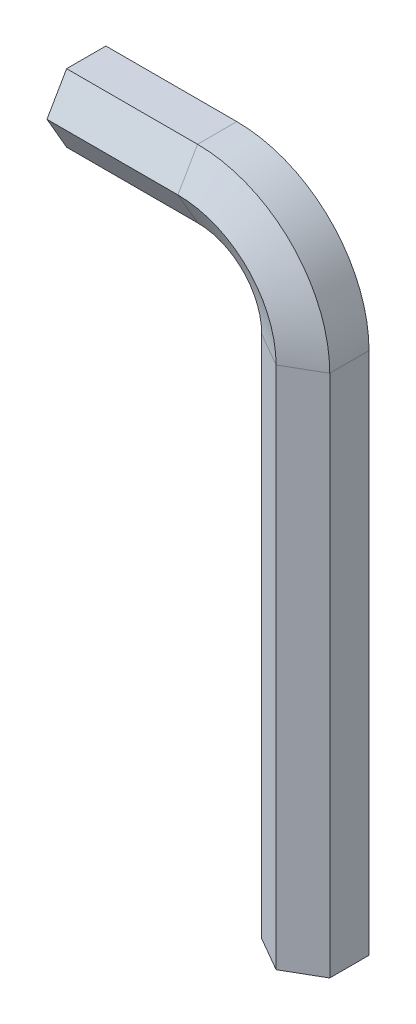
ISO-10303-21;
HEADER;
FILE_DESCRIPTION(('STEP AP214'),'2;1');
FILE_NAME('part.step','',(''),(''),'','','');
FILE_SCHEMA(('AUTOMOTIVE_DESIGN { 1 0 10303 214 1 1 1 1 }'));
ENDSEC;
DATA;
#1=APPLICATION_CONTEXT('core data for automotive mechanical design processes');
#2=APPLICATION_PROTOCOL_DEFINITION('international standard','automotive_design',2000,#1);
#3=PRODUCT_CONTEXT('',#1,'mechanical');
#4=PRODUCT('Part','Part','',(#3));
#5=PRODUCT_RELATED_PRODUCT_CATEGORY('part','',(#4));
#6=PRODUCT_DEFINITION_FORMATION('','',#4);
#7=PRODUCT_DEFINITION_CONTEXT('part definition',#1,'design');
#8=PRODUCT_DEFINITION('design','',#6,#7);
#9=PRODUCT_DEFINITION_SHAPE('','',#8);
#10=(LENGTH_UNIT() NAMED_UNIT(*) SI_UNIT(.MILLI.,.METRE.));
#11=(NAMED_UNIT(*) PLANE_ANGLE_UNIT() SI_UNIT($,.RADIAN.));
#12=(NAMED_UNIT(*) SI_UNIT($,.STERADIAN.) SOLID_ANGLE_UNIT());
#13=UNCERTAINTY_MEASURE_WITH_UNIT(LENGTH_MEASURE(1.E-05),#10,'distance_accuracy_value','');
#14=(GEOMETRIC_REPRESENTATION_CONTEXT(3) GLOBAL_UNCERTAINTY_ASSIGNED_CONTEXT((#13)) GLOBAL_UNIT_ASSIGNED_CONTEXT((#10,
#11,#12)) REPRESENTATION_CONTEXT('',''));
#15=CARTESIAN_POINT('',(0.,0.,0.));
#16=DIRECTION('',(0.,0.,1.));
#17=DIRECTION('',(1.,0.,0.));
#18=AXIS2_PLACEMENT_3D('',#15,#16,#17);
#19=CARTESIAN_POINT('',(-95.,0.,0.));
#20=DIRECTION('',(0.,1.,0.));
#21=DIRECTION('',(0.,0.,1.));
#22=AXIS2_PLACEMENT_3D('',#19,#20,#21);
#23=PLANE('',#22);
#24=DIRECTION('',(0.866025403784439,0.,0.5));
#25=VECTOR('',#24,1.);
#26=CARTESIAN_POINT('',(-5.19615242270663,0.,3.));
#27=LINE('',#26,#25);
#28=CARTESIAN_POINT('',(-5.19615242270663,0.,3.));
#29=VERTEX_POINT('',#28);
#30=CARTESIAN_POINT('',(0.,0.,6.));
#31=VERTEX_POINT('',#30);
#32=EDGE_CURVE('E196',#29,#31,#27,.T.);
#33=ORIENTED_EDGE('',*,*,#32,.F.);
#34=DIRECTION('',(0.,0.,1.));
#35=VECTOR('',#34,1.);
#36=CARTESIAN_POINT('',(-5.19615242270663,0.,-3.));
#37=LINE('',#36,#35);
#38=CARTESIAN_POINT('',(-5.19615242270663,0.,-3.));
#39=VERTEX_POINT('',#38);
#40=EDGE_CURVE('E258',#39,#29,#37,.T.);
#41=ORIENTED_EDGE('',*,*,#40,.F.);
#42=DIRECTION('',(-0.866025403784438,0.,0.5));
#43=VECTOR('',#42,1.);
#44=CARTESIAN_POINT('',(0.,0.,-6.));
#45=LINE('',#44,#43);
#46=CARTESIAN_POINT('',(0.,0.,-6.));
#47=VERTEX_POINT('',#46);
#48=EDGE_CURVE('E238',#47,#39,#45,.T.);
#49=ORIENTED_EDGE('',*,*,#48,.F.);
#50=DIRECTION('',(-0.866025403784438,0.,-0.5));
#51=VECTOR('',#50,1.);
#52=CARTESIAN_POINT('',(5.19615242270663,0.,-3.));
#53=LINE('',#52,#51);
#54=CARTESIAN_POINT('',(5.19615242270663,0.,-3.));
#55=VERTEX_POINT('',#54);
#56=EDGE_CURVE('E142',#55,#47,#53,.T.);
#57=ORIENTED_EDGE('',*,*,#56,.F.);
#58=DIRECTION('',(0.,0.,-1.));
#59=VECTOR('',#58,1.);
#60=CARTESIAN_POINT('',(5.19615242270663,0.,3.));
#61=LINE('',#60,#59);
#62=CARTESIAN_POINT('',(5.19615242270663,0.,3.));
#63=VERTEX_POINT('',#62);
#64=EDGE_CURVE('E146',#63,#55,#61,.T.);
#65=ORIENTED_EDGE('',*,*,#64,.F.);
#66=DIRECTION('',(0.866025403784439,0.,-0.5));
#67=VECTOR('',#66,1.);
#68=CARTESIAN_POINT('',(0.,0.,6.));
#69=LINE('',#68,#67);
#70=EDGE_CURVE('E151',#31,#63,#69,.T.);
#71=ORIENTED_EDGE('',*,*,#70,.F.);
#72=EDGE_LOOP('',(#33,#41,#49,#57,#65,#71));
#73=FACE_BOUND('',#72,.T.);
#74=ADVANCED_FACE('F40',(#73),#23,.F.);
#75=CARTESIAN_POINT('',(-35.,0.,0.));
#76=DIRECTION('',(-1.,0.,0.));
#77=DIRECTION('',(0.,0.,1.));
#78=AXIS2_PLACEMENT_3D('',#75,#76,#77);
#79=PLANE('',#78);
#80=DIRECTION('',(0.,0.866025403784439,0.5));
#81=VECTOR('',#80,1.);
#82=CARTESIAN_POINT('',(-35.,89.8038475772934,3.));
#83=LINE('',#82,#81);
#84=CARTESIAN_POINT('',(-35.,89.8038475772934,3.));
#85=VERTEX_POINT('',#84);
#86=CARTESIAN_POINT('',(-35.,95.,6.));
#87=VERTEX_POINT('',#86);
#88=EDGE_CURVE('E162',#85,#87,#83,.T.);
#89=ORIENTED_EDGE('',*,*,#88,.T.);
#90=DIRECTION('',(0.,0.866025403784439,-0.5));
#91=VECTOR('',#90,1.);
#92=CARTESIAN_POINT('',(-35.,95.,6.));
#93=LINE('',#92,#91);
#94=CARTESIAN_POINT('',(-35.,100.196152422707,3.));
#95=VERTEX_POINT('',#94);
#96=EDGE_CURVE('E165',#87,#95,#93,.T.);
#97=ORIENTED_EDGE('',*,*,#96,.T.);
#98=DIRECTION('',(0.,0.,-1.));
#99=VECTOR('',#98,1.);
#100=CARTESIAN_POINT('',(-35.,100.196152422707,3.));
#101=LINE('',#100,#99);
#102=CARTESIAN_POINT('',(-35.,100.196152422707,-3.));
#103=VERTEX_POINT('',#102);
#104=EDGE_CURVE('E216',#95,#103,#101,.T.);
#105=ORIENTED_EDGE('',*,*,#104,.T.);
#106=DIRECTION('',(0.,-0.866025403784438,-0.5));
#107=VECTOR('',#106,1.);
#108=CARTESIAN_POINT('',(-35.,100.196152422707,-3.));
#109=LINE('',#108,#107);
#110=CARTESIAN_POINT('',(-35.,95.,-6.));
#111=VERTEX_POINT('',#110);
#112=EDGE_CURVE('E60',#103,#111,#109,.T.);
#113=ORIENTED_EDGE('',*,*,#112,.T.);
#114=DIRECTION('',(0.,-0.866025403784438,0.5));
#115=VECTOR('',#114,1.);
#116=CARTESIAN_POINT('',(-35.,95.,-6.));
#117=LINE('',#116,#115);
#118=CARTESIAN_POINT('',(-35.,89.8038475772934,-3.));
#119=VERTEX_POINT('',#118);
#120=EDGE_CURVE('E54',#111,#119,#117,.T.);
#121=ORIENTED_EDGE('',*,*,#120,.T.);
#122=DIRECTION('',(0.,0.,1.));
#123=VECTOR('',#122,1.);
#124=CARTESIAN_POINT('',(-35.,89.8038475772934,-3.));
#125=LINE('',#124,#123);
#126=EDGE_CURVE('E11',#119,#85,#125,.T.);
#127=ORIENTED_EDGE('',*,*,#126,.T.);
#128=EDGE_LOOP('',(#89,#97,#105,#113,#121,#127));
#129=FACE_BOUND('',#128,.T.);
#130=ADVANCED_FACE('F164',(#129),#79,.T.);
#131=CARTESIAN_POINT('',(-5.19615242270663,0.,3.));
#132=DIRECTION('',(-0.5,0.,0.866025403784439));
#133=DIRECTION('',(0.866025403784439,0.,0.5));
#134=AXIS2_PLACEMENT_3D('',#131,#132,#133);
#135=PLANE('',#134);
#136=DIRECTION('',(0.,1.,0.));
#137=VECTOR('',#136,1.);
#138=CARTESIAN_POINT('',(0.,0.,6.));
#139=LINE('',#138,#137);
#140=CARTESIAN_POINT('',(0.,80.,6.));
#141=VERTEX_POINT('',#140);
#142=EDGE_CURVE('E202',#31,#141,#139,.T.);
#143=ORIENTED_EDGE('',*,*,#142,.T.);
#144=DIRECTION('',(0.866025403784439,0.,0.5));
#145=VECTOR('',#144,1.);
#146=CARTESIAN_POINT('',(-5.19615242270663,80.,3.));
#147=LINE('',#146,#145);
#148=CARTESIAN_POINT('',(-5.19615242270663,80.,3.));
#149=VERTEX_POINT('',#148);
#150=EDGE_CURVE('E305',#149,#141,#147,.T.);
#151=ORIENTED_EDGE('',*,*,#150,.F.);
#152=DIRECTION('',(0.,1.,0.));
#153=VECTOR('',#152,1.);
#154=CARTESIAN_POINT('',(-5.19615242270663,0.,3.));
#155=LINE('',#154,#153);
#156=EDGE_CURVE('E279',#29,#149,#155,.T.);
#157=ORIENTED_EDGE('',*,*,#156,.F.);
#158=ORIENTED_EDGE('',*,*,#32,.T.);
#159=EDGE_LOOP('',(#143,#151,#157,#158));
#160=FACE_BOUND('',#159,.T.);
#161=ADVANCED_FACE('F316',(#160),#135,.T.);
#162=CARTESIAN_POINT('',(0.,0.,6.));
#163=DIRECTION('',(0.5,0.,0.866025403784438));
#164=DIRECTION('',(0.866025403784438,0.,-0.5));
#165=AXIS2_PLACEMENT_3D('',#162,#163,#164);
#166=PLANE('',#165);
#167=DIRECTION('',(0.,1.,0.));
#168=VECTOR('',#167,1.);
#169=CARTESIAN_POINT('',(5.19615242270663,0.,3.));
#170=LINE('',#169,#168);
#171=CARTESIAN_POINT('',(5.19615242270663,80.,3.));
#172=VERTEX_POINT('',#171);
#173=EDGE_CURVE('E201',#63,#172,#170,.T.);
#174=ORIENTED_EDGE('',*,*,#173,.T.);
#175=DIRECTION('',(0.866025403784439,0.,-0.5));
#176=VECTOR('',#175,1.);
#177=CARTESIAN_POINT('',(0.,80.,6.));
#178=LINE('',#177,#176);
#179=EDGE_CURVE('E197',#141,#172,#178,.T.);
#180=ORIENTED_EDGE('',*,*,#179,.F.);
#181=ORIENTED_EDGE('',*,*,#142,.F.);
#182=ORIENTED_EDGE('',*,*,#70,.T.);
#183=EDGE_LOOP('',(#174,#180,#181,#182));
#184=FACE_BOUND('',#183,.T.);
#185=ADVANCED_FACE('F319',(#184),#166,.T.);
#186=CARTESIAN_POINT('',(5.19615242270663,0.,3.));
#187=DIRECTION('',(1.,0.,0.));
#188=DIRECTION('',(0.,0.,-1.));
#189=AXIS2_PLACEMENT_3D('',#186,#187,#188);
#190=PLANE('',#189);
#191=DIRECTION('',(0.,1.,0.));
#192=VECTOR('',#191,1.);
#193=CARTESIAN_POINT('',(5.19615242270663,0.,-3.));
#194=LINE('',#193,#192);
#195=CARTESIAN_POINT('',(5.19615242270663,80.,-3.));
#196=VERTEX_POINT('',#195);
#197=EDGE_CURVE('E221',#55,#196,#194,.T.);
#198=ORIENTED_EDGE('',*,*,#197,.T.);
#199=DIRECTION('',(0.,0.,-1.));
#200=VECTOR('',#199,1.);
#201=CARTESIAN_POINT('',(5.19615242270663,80.,3.));
#202=LINE('',#201,#200);
#203=EDGE_CURVE('E206',#172,#196,#202,.T.);
#204=ORIENTED_EDGE('',*,*,#203,.F.);
#205=ORIENTED_EDGE('',*,*,#173,.F.);
#206=ORIENTED_EDGE('',*,*,#64,.T.);
#207=EDGE_LOOP('',(#198,#204,#205,#206));
#208=FACE_BOUND('',#207,.T.);
#209=ADVANCED_FACE('F369',(#208),#190,.T.);
#210=CARTESIAN_POINT('',(5.19615242270663,0.,-3.));
#211=DIRECTION('',(0.5,0.,-0.866025403784438));
#212=DIRECTION('',(-0.866025403784438,0.,-0.5));
#213=AXIS2_PLACEMENT_3D('',#210,#211,#212);
#214=PLANE('',#213);
#215=DIRECTION('',(0.,1.,0.));
#216=VECTOR('',#215,1.);
#217=CARTESIAN_POINT('',(0.,0.,-6.));
#218=LINE('',#217,#216);
#219=CARTESIAN_POINT('',(0.,80.,-6.));
#220=VERTEX_POINT('',#219);
#221=EDGE_CURVE('E241',#47,#220,#218,.T.);
#222=ORIENTED_EDGE('',*,*,#221,.T.);
#223=DIRECTION('',(-0.866025403784438,0.,-0.5));
#224=VECTOR('',#223,1.);
#225=CARTESIAN_POINT('',(5.19615242270663,80.,-3.));
#226=LINE('',#225,#224);
#227=EDGE_CURVE('E225',#196,#220,#226,.T.);
#228=ORIENTED_EDGE('',*,*,#227,.F.);
#229=ORIENTED_EDGE('',*,*,#197,.F.);
#230=ORIENTED_EDGE('',*,*,#56,.T.);
#231=EDGE_LOOP('',(#222,#228,#229,#230));
#232=FACE_BOUND('',#231,.T.);
#233=ADVANCED_FACE('F377',(#232),#214,.T.);
#234=CARTESIAN_POINT('',(0.,0.,-6.));
#235=DIRECTION('',(-0.5,0.,-0.866025403784438));
#236=DIRECTION('',(-0.866025403784438,0.,0.5));
#237=AXIS2_PLACEMENT_3D('',#234,#235,#236);
#238=PLANE('',#237);
#239=DIRECTION('',(0.,1.,0.));
#240=VECTOR('',#239,1.);
#241=CARTESIAN_POINT('',(-5.19615242270663,0.,-3.));
#242=LINE('',#241,#240);
#243=CARTESIAN_POINT('',(-5.19615242270663,80.,-3.));
#244=VERTEX_POINT('',#243);
#245=EDGE_CURVE('E261',#39,#244,#242,.T.);
#246=ORIENTED_EDGE('',*,*,#245,.T.);
#247=DIRECTION('',(-0.866025403784438,0.,0.5));
#248=VECTOR('',#247,1.);
#249=CARTESIAN_POINT('',(0.,80.,-6.));
#250=LINE('',#249,#248);
#251=EDGE_CURVE('E245',#220,#244,#250,.T.);
#252=ORIENTED_EDGE('',*,*,#251,.F.);
#253=ORIENTED_EDGE('',*,*,#221,.F.);
#254=ORIENTED_EDGE('',*,*,#48,.T.);
#255=EDGE_LOOP('',(#246,#252,#253,#254));
#256=FACE_BOUND('',#255,.T.);
#257=ADVANCED_FACE('F387',(#256),#238,.T.);
#258=CARTESIAN_POINT('',(-5.19615242270663,0.,-3.));
#259=DIRECTION('',(-1.,0.,0.));
#260=DIRECTION('',(0.,0.,1.));
#261=AXIS2_PLACEMENT_3D('',#258,#259,#260);
#262=PLANE('',#261);
#263=DIRECTION('',(0.,0.,1.));
#264=VECTOR('',#263,1.);
#265=CARTESIAN_POINT('',(-5.19615242270663,80.,-3.));
#266=LINE('',#265,#264);
#267=EDGE_CURVE('E265',#244,#149,#266,.T.);
#268=ORIENTED_EDGE('',*,*,#267,.F.);
#269=ORIENTED_EDGE('',*,*,#245,.F.);
#270=ORIENTED_EDGE('',*,*,#40,.T.);
#271=ORIENTED_EDGE('',*,*,#156,.T.);
#272=EDGE_LOOP('',(#268,#269,#270,#271));
#273=FACE_BOUND('',#272,.T.);
#274=ADVANCED_FACE('F332',(#273),#262,.T.);
#275=CARTESIAN_POINT('',(-15.,80.,3.));
#276=DIRECTION('',(0.,0.,1.));
#277=DIRECTION('',(1.,0.,0.));
#278=AXIS2_PLACEMENT_3D('',#275,#276,#277);
#279=CONICAL_SURFACE('',#278,9.80384757729337,1.0471975511966);
#280=CARTESIAN_POINT('',(-15.,80.,6.));
#281=DIRECTION('',(0.,0.,1.));
#282=DIRECTION('',(1.,0.,0.));
#283=AXIS2_PLACEMENT_3D('',#280,#281,#282);
#284=CIRCLE('',#283,15.);
#285=CARTESIAN_POINT('',(-14.9999999999999,95.,6.));
#286=VERTEX_POINT('',#285);
#287=EDGE_CURVE('E210',#141,#286,#284,.T.);
#288=ORIENTED_EDGE('',*,*,#287,.T.);
#289=DIRECTION('',(0.,0.866025403784439,0.5));
#290=VECTOR('',#289,1.);
#291=CARTESIAN_POINT('',(-14.9999999999999,89.8038475772934,3.));
#292=LINE('',#291,#290);
#293=CARTESIAN_POINT('',(-14.9999999999999,89.8038475772934,3.));
#294=VERTEX_POINT('',#293);
#295=EDGE_CURVE('E185',#294,#286,#292,.T.);
#296=ORIENTED_EDGE('',*,*,#295,.F.);
#297=CARTESIAN_POINT('',(-15.,80.,3.));
#298=DIRECTION('',(0.,0.,1.));
#299=DIRECTION('',(1.,0.,0.));
#300=AXIS2_PLACEMENT_3D('',#297,#298,#299);
#301=CIRCLE('',#300,9.80384757729337);
#302=EDGE_CURVE('E282',#149,#294,#301,.T.);
#303=ORIENTED_EDGE('',*,*,#302,.F.);
#304=ORIENTED_EDGE('',*,*,#150,.T.);
#305=EDGE_LOOP('',(#288,#296,#303,#304));
#306=FACE_BOUND('',#305,.T.);
#307=ADVANCED_FACE('F290',(#306),#279,.F.);
#308=CARTESIAN_POINT('',(-15.,80.,6.));
#309=DIRECTION('',(0.,0.,-1.));
#310=DIRECTION('',(-1.,0.,0.));
#311=AXIS2_PLACEMENT_3D('',#308,#309,#310);
#312=CONICAL_SURFACE('',#311,15.,1.0471975511966);
#313=CARTESIAN_POINT('',(-15.,80.,3.));
#314=DIRECTION('',(0.,0.,1.));
#315=DIRECTION('',(1.,0.,0.));
#316=AXIS2_PLACEMENT_3D('',#313,#314,#315);
#317=CIRCLE('',#316,20.1961524227066);
#318=CARTESIAN_POINT('',(-14.9999999999999,100.196152422707,3.));
#319=VERTEX_POINT('',#318);
#320=EDGE_CURVE('E129',#172,#319,#317,.T.);
#321=ORIENTED_EDGE('',*,*,#320,.T.);
#322=DIRECTION('',(0.,0.866025403784439,-0.5));
#323=VECTOR('',#322,1.);
#324=CARTESIAN_POINT('',(-14.9999999999999,95.,6.));
#325=LINE('',#324,#323);
#326=EDGE_CURVE('E207',#286,#319,#325,.T.);
#327=ORIENTED_EDGE('',*,*,#326,.F.);
#328=ORIENTED_EDGE('',*,*,#287,.F.);
#329=ORIENTED_EDGE('',*,*,#179,.T.);
#330=EDGE_LOOP('',(#321,#327,#328,#329));
#331=FACE_BOUND('',#330,.T.);
#332=ADVANCED_FACE('F322',(#331),#312,.T.);
#333=CARTESIAN_POINT('',(-15.,80.,0.));
#334=DIRECTION('',(0.,0.,1.));
#335=DIRECTION('',(1.,0.,0.));
#336=AXIS2_PLACEMENT_3D('',#333,#334,#335);
#337=CYLINDRICAL_SURFACE('',#336,20.1961524227066);
#338=CARTESIAN_POINT('',(-15.,80.,-3.));
#339=DIRECTION('',(0.,0.,1.));
#340=DIRECTION('',(1.,0.,0.));
#341=AXIS2_PLACEMENT_3D('',#338,#339,#340);
#342=CIRCLE('',#341,20.1961524227066);
#343=CARTESIAN_POINT('',(-14.9999999999999,100.196152422707,-3.));
#344=VERTEX_POINT('',#343);
#345=EDGE_CURVE('E120',#196,#344,#342,.T.);
#346=ORIENTED_EDGE('',*,*,#345,.T.);
#347=DIRECTION('',(0.,0.,-1.));
#348=VECTOR('',#347,1.);
#349=CARTESIAN_POINT('',(-14.9999999999999,100.196152422707,3.));
#350=LINE('',#349,#348);
#351=EDGE_CURVE('E212',#319,#344,#350,.T.);
#352=ORIENTED_EDGE('',*,*,#351,.F.);
#353=ORIENTED_EDGE('',*,*,#320,.F.);
#354=ORIENTED_EDGE('',*,*,#203,.T.);
#355=EDGE_LOOP('',(#346,#352,#353,#354));
#356=FACE_BOUND('',#355,.T.);
#357=ADVANCED_FACE('F324',(#356),#337,.T.);
#358=CARTESIAN_POINT('',(-15.,80.,-3.));
#359=DIRECTION('',(0.,0.,1.));
#360=DIRECTION('',(1.,0.,0.));
#361=AXIS2_PLACEMENT_3D('',#358,#359,#360);
#362=CONICAL_SURFACE('',#361,20.1961524227066,1.0471975511966);
#363=CARTESIAN_POINT('',(-15.,80.,-6.));
#364=DIRECTION('',(0.,0.,1.));
#365=DIRECTION('',(1.,0.,0.));
#366=AXIS2_PLACEMENT_3D('',#363,#364,#365);
#367=CIRCLE('',#366,15.);
#368=CARTESIAN_POINT('',(-14.9999999999999,95.,-6.));
#369=VERTEX_POINT('',#368);
#370=EDGE_CURVE('E113',#220,#369,#367,.T.);
#371=ORIENTED_EDGE('',*,*,#370,.T.);
#372=DIRECTION('',(0.,-0.866025403784438,-0.5));
#373=VECTOR('',#372,1.);
#374=CARTESIAN_POINT('',(-14.9999999999999,100.196152422707,-3.));
#375=LINE('',#374,#373);
#376=EDGE_CURVE('E231',#344,#369,#375,.T.);
#377=ORIENTED_EDGE('',*,*,#376,.F.);
#378=ORIENTED_EDGE('',*,*,#345,.F.);
#379=ORIENTED_EDGE('',*,*,#227,.T.);
#380=EDGE_LOOP('',(#371,#377,#378,#379));
#381=FACE_BOUND('',#380,.T.);
#382=ADVANCED_FACE('F330',(#381),#362,.T.);
#383=CARTESIAN_POINT('',(-15.,80.,-6.));
#384=DIRECTION('',(0.,0.,-1.));
#385=DIRECTION('',(-1.,0.,0.));
#386=AXIS2_PLACEMENT_3D('',#383,#384,#385);
#387=CONICAL_SURFACE('',#386,15.,1.0471975511966);
#388=CARTESIAN_POINT('',(-15.,80.,-3.));
#389=DIRECTION('',(0.,0.,1.));
#390=DIRECTION('',(1.,0.,0.));
#391=AXIS2_PLACEMENT_3D('',#388,#389,#390);
#392=CIRCLE('',#391,9.80384757729337);
#393=CARTESIAN_POINT('',(-14.9999999999999,89.8038475772934,-3.));
#394=VERTEX_POINT('',#393);
#395=EDGE_CURVE('E268',#244,#394,#392,.T.);
#396=ORIENTED_EDGE('',*,*,#395,.T.);
#397=DIRECTION('',(0.,-0.866025403784438,0.5));
#398=VECTOR('',#397,1.);
#399=CARTESIAN_POINT('',(-14.9999999999999,95.,-6.));
#400=LINE('',#399,#398);
#401=EDGE_CURVE('E250',#369,#394,#400,.T.);
#402=ORIENTED_EDGE('',*,*,#401,.F.);
#403=ORIENTED_EDGE('',*,*,#370,.F.);
#404=ORIENTED_EDGE('',*,*,#251,.T.);
#405=EDGE_LOOP('',(#396,#402,#403,#404));
#406=FACE_BOUND('',#405,.T.);
#407=ADVANCED_FACE('F423',(#406),#387,.F.);
#408=CARTESIAN_POINT('',(-15.,80.,0.));
#409=DIRECTION('',(0.,0.,1.));
#410=DIRECTION('',(1.,0.,0.));
#411=AXIS2_PLACEMENT_3D('',#408,#409,#410);
#412=CYLINDRICAL_SURFACE('',#411,9.80384757729337);
#413=DIRECTION('',(0.,0.,1.));
#414=VECTOR('',#413,1.);
#415=CARTESIAN_POINT('',(-14.9999999999999,89.8038475772934,-3.));
#416=LINE('',#415,#414);
#417=EDGE_CURVE('E193',#394,#294,#416,.T.);
#418=ORIENTED_EDGE('',*,*,#417,.F.);
#419=ORIENTED_EDGE('',*,*,#395,.F.);
#420=ORIENTED_EDGE('',*,*,#267,.T.);
#421=ORIENTED_EDGE('',*,*,#302,.T.);
#422=EDGE_LOOP('',(#418,#419,#420,#421));
#423=FACE_BOUND('',#422,.T.);
#424=ADVANCED_FACE('F294',(#423),#412,.F.);
#425=CARTESIAN_POINT('',(-15.,89.8038475772934,3.));
#426=DIRECTION('',(0.,-0.5,0.866025403784439));
#427=DIRECTION('',(0.,-0.866025403784439,-0.5));
#428=AXIS2_PLACEMENT_3D('',#425,#426,#427);
#429=PLANE('',#428);
#430=DIRECTION('',(-1.,0.,0.));
#431=VECTOR('',#430,1.);
#432=CARTESIAN_POINT('',(-15.,95.,6.));
#433=LINE('',#432,#431);
#434=EDGE_CURVE('E171',#286,#87,#433,.T.);
#435=ORIENTED_EDGE('',*,*,#434,.T.);
#436=ORIENTED_EDGE('',*,*,#88,.F.);
#437=DIRECTION('',(-1.,0.,0.));
#438=VECTOR('',#437,1.);
#439=CARTESIAN_POINT('',(-15.,89.8038475772934,3.));
#440=LINE('',#439,#438);
#441=EDGE_CURVE('E172',#294,#85,#440,.T.);
#442=ORIENTED_EDGE('',*,*,#441,.F.);
#443=ORIENTED_EDGE('',*,*,#295,.T.);
#444=EDGE_LOOP('',(#435,#436,#442,#443));
#445=FACE_BOUND('',#444,.T.);
#446=ADVANCED_FACE('F183',(#445),#429,.T.);
#447=CARTESIAN_POINT('',(-15.,95.,6.));
#448=DIRECTION('',(0.,0.5,0.866025403784438));
#449=DIRECTION('',(0.,-0.866025403784439,0.5));
#450=AXIS2_PLACEMENT_3D('',#447,#448,#449);
#451=PLANE('',#450);
#452=DIRECTION('',(-1.,0.,0.));
#453=VECTOR('',#452,1.);
#454=CARTESIAN_POINT('',(-15.,100.196152422707,3.));
#455=LINE('',#454,#453);
#456=EDGE_CURVE('E179',#319,#95,#455,.T.);
#457=ORIENTED_EDGE('',*,*,#456,.T.);
#458=ORIENTED_EDGE('',*,*,#96,.F.);
#459=ORIENTED_EDGE('',*,*,#434,.F.);
#460=ORIENTED_EDGE('',*,*,#326,.T.);
#461=EDGE_LOOP('',(#457,#458,#459,#460));
#462=FACE_BOUND('',#461,.T.);
#463=ADVANCED_FACE('F176',(#462),#451,.T.);
#464=CARTESIAN_POINT('',(-15.,100.196152422707,3.));
#465=DIRECTION('',(0.,1.,0.));
#466=DIRECTION('',(0.,0.,1.));
#467=AXIS2_PLACEMENT_3D('',#464,#465,#466);
#468=PLANE('',#467);
#469=DIRECTION('',(-1.,0.,0.));
#470=VECTOR('',#469,1.);
#471=CARTESIAN_POINT('',(-15.,100.196152422707,-3.));
#472=LINE('',#471,#470);
#473=EDGE_CURVE('E98',#344,#103,#472,.T.);
#474=ORIENTED_EDGE('',*,*,#473,.T.);
#475=ORIENTED_EDGE('',*,*,#104,.F.);
#476=ORIENTED_EDGE('',*,*,#456,.F.);
#477=ORIENTED_EDGE('',*,*,#351,.T.);
#478=EDGE_LOOP('',(#474,#475,#476,#477));
#479=FACE_BOUND('',#478,.T.);
#480=ADVANCED_FACE('F441',(#479),#468,.T.);
#481=CARTESIAN_POINT('',(-15.,100.196152422707,-3.));
#482=DIRECTION('',(0.,0.5,-0.866025403784438));
#483=DIRECTION('',(0.,0.866025403784439,0.5));
#484=AXIS2_PLACEMENT_3D('',#481,#482,#483);
#485=PLANE('',#484);
#486=DIRECTION('',(-1.,0.,0.));
#487=VECTOR('',#486,1.);
#488=CARTESIAN_POINT('',(-15.,95.,-6.));
#489=LINE('',#488,#487);
#490=EDGE_CURVE('E90',#369,#111,#489,.T.);
#491=ORIENTED_EDGE('',*,*,#490,.T.);
#492=ORIENTED_EDGE('',*,*,#112,.F.);
#493=ORIENTED_EDGE('',*,*,#473,.F.);
#494=ORIENTED_EDGE('',*,*,#376,.T.);
#495=EDGE_LOOP('',(#491,#492,#493,#494));
#496=FACE_BOUND('',#495,.T.);
#497=ADVANCED_FACE('F342',(#496),#485,.T.);
#498=CARTESIAN_POINT('',(-15.,95.,-6.));
#499=DIRECTION('',(0.,-0.5,-0.866025403784438));
#500=DIRECTION('',(0.,0.866025403784438,-0.5));
#501=AXIS2_PLACEMENT_3D('',#498,#499,#500);
#502=PLANE('',#501);
#503=DIRECTION('',(-1.,0.,0.));
#504=VECTOR('',#503,1.);
#505=CARTESIAN_POINT('',(-15.,89.8038475772934,-3.));
#506=LINE('',#505,#504);
#507=EDGE_CURVE('E48',#394,#119,#506,.T.);
#508=ORIENTED_EDGE('',*,*,#507,.T.);
#509=ORIENTED_EDGE('',*,*,#120,.F.);
#510=ORIENTED_EDGE('',*,*,#490,.F.);
#511=ORIENTED_EDGE('',*,*,#401,.T.);
#512=EDGE_LOOP('',(#508,#509,#510,#511));
#513=FACE_BOUND('',#512,.T.);
#514=ADVANCED_FACE('F337',(#513),#502,.T.);
#515=CARTESIAN_POINT('',(-15.,89.8038475772934,-3.));
#516=DIRECTION('',(0.,-1.,0.));
#517=DIRECTION('',(0.,0.,-1.));
#518=AXIS2_PLACEMENT_3D('',#515,#516,#517);
#519=PLANE('',#518);
#520=ORIENTED_EDGE('',*,*,#126,.F.);
#521=ORIENTED_EDGE('',*,*,#507,.F.);
#522=ORIENTED_EDGE('',*,*,#417,.T.);
#523=ORIENTED_EDGE('',*,*,#441,.T.);
#524=EDGE_LOOP('',(#520,#521,#522,#523));
#525=FACE_BOUND('',#524,.T.);
#526=ADVANCED_FACE('F285',(#525),#519,.T.);
#527=CLOSED_SHELL('',(#74,#130,#161,#185,#209,#233,#257,#274,#307,#332,#357,#382,#407,#424,#446,
#463,#480,#497,#514,#526));
#528=MANIFOLD_SOLID_BREP('B2',#527);
#529=ADVANCED_BREP_SHAPE_REPRESENTATION('',(#18,#528),#14);
#530=SHAPE_DEFINITION_REPRESENTATION(#9,#529);
ENDSEC;
END-ISO-10303-21;
